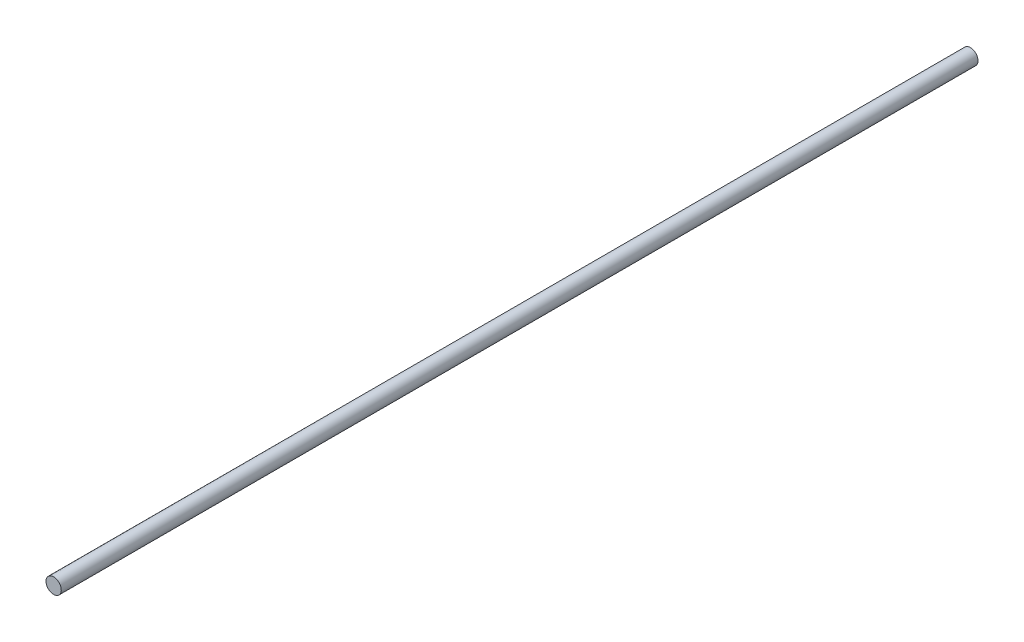
ISO-10303-21;
HEADER;
FILE_DESCRIPTION(('STEP AP214'),'2;1');
FILE_NAME('part.step','',(''),(''),'','','');
FILE_SCHEMA(('AUTOMOTIVE_DESIGN { 1 0 10303 214 1 1 1 1 }'));
ENDSEC;
DATA;
#1=APPLICATION_CONTEXT('core data for automotive mechanical design processes');
#2=APPLICATION_PROTOCOL_DEFINITION('international standard','automotive_design',2000,#1);
#3=PRODUCT_CONTEXT('',#1,'mechanical');
#4=PRODUCT('Part','Part','',(#3));
#5=PRODUCT_RELATED_PRODUCT_CATEGORY('part','',(#4));
#6=PRODUCT_DEFINITION_FORMATION('','',#4);
#7=PRODUCT_DEFINITION_CONTEXT('part definition',#1,'design');
#8=PRODUCT_DEFINITION('design','',#6,#7);
#9=PRODUCT_DEFINITION_SHAPE('','',#8);
#10=(LENGTH_UNIT() NAMED_UNIT(*) SI_UNIT(.MILLI.,.METRE.));
#11=(NAMED_UNIT(*) PLANE_ANGLE_UNIT() SI_UNIT($,.RADIAN.));
#12=(NAMED_UNIT(*) SI_UNIT($,.STERADIAN.) SOLID_ANGLE_UNIT());
#13=UNCERTAINTY_MEASURE_WITH_UNIT(LENGTH_MEASURE(1.E-05),#10,'distance_accuracy_value','');
#14=(GEOMETRIC_REPRESENTATION_CONTEXT(3) GLOBAL_UNCERTAINTY_ASSIGNED_CONTEXT((#13)) GLOBAL_UNIT_ASSIGNED_CONTEXT((#10,
#11,#12)) REPRESENTATION_CONTEXT('',''));
#15=CARTESIAN_POINT('',(0.,0.,0.));
#16=DIRECTION('',(0.,0.,1.));
#17=DIRECTION('',(1.,0.,0.));
#18=AXIS2_PLACEMENT_3D('',#15,#16,#17);
#19=CARTESIAN_POINT('',(0.,0.,150.));
#20=DIRECTION('',(0.,0.,-1.));
#21=DIRECTION('',(-1.,0.,0.));
#22=AXIS2_PLACEMENT_3D('',#19,#20,#21);
#23=CYLINDRICAL_SURFACE('',#22,1.25);
#24=CARTESIAN_POINT('',(0.,0.,150.));
#25=DIRECTION('',(0.,0.,1.));
#26=DIRECTION('',(1.,0.,0.));
#27=AXIS2_PLACEMENT_3D('',#24,#25,#26);
#28=CIRCLE('',#27,1.25);
#29=CARTESIAN_POINT('',(1.25,0.,150.));
#30=VERTEX_POINT('',#29);
#31=EDGE_CURVE('E10',#30,#30,#28,.T.);
#32=ORIENTED_EDGE('',*,*,#31,.F.);
#33=EDGE_LOOP('',(#32));
#34=FACE_BOUND('',#33,.T.);
#35=CARTESIAN_POINT('',(0.,0.,0.));
#36=DIRECTION('',(0.,0.,1.));
#37=DIRECTION('',(1.,0.,0.));
#38=AXIS2_PLACEMENT_3D('',#35,#36,#37);
#39=CIRCLE('',#38,1.25);
#40=CARTESIAN_POINT('',(1.25,0.,0.));
#41=VERTEX_POINT('',#40);
#42=EDGE_CURVE('E40',#41,#41,#39,.T.);
#43=ORIENTED_EDGE('',*,*,#42,.T.);
#44=EDGE_LOOP('',(#43));
#45=FACE_BOUND('',#44,.T.);
#46=ADVANCED_FACE('F37',(#34,#45),#23,.T.);
#47=CARTESIAN_POINT('',(0.,0.,150.));
#48=DIRECTION('',(0.,0.,1.));
#49=DIRECTION('',(1.,0.,0.));
#50=AXIS2_PLACEMENT_3D('',#47,#48,#49);
#51=PLANE('',#50);
#52=ORIENTED_EDGE('',*,*,#31,.T.);
#53=EDGE_LOOP('',(#52));
#54=FACE_BOUND('',#53,.T.);
#55=ADVANCED_FACE('F54',(#54),#51,.T.);
#56=CARTESIAN_POINT('',(0.,0.,0.));
#57=DIRECTION('',(0.,0.,1.));
#58=DIRECTION('',(1.,0.,0.));
#59=AXIS2_PLACEMENT_3D('',#56,#57,#58);
#60=PLANE('',#59);
#61=ORIENTED_EDGE('',*,*,#42,.F.);
#62=EDGE_LOOP('',(#61));
#63=FACE_BOUND('',#62,.T.);
#64=ADVANCED_FACE('F52',(#63),#60,.F.);
#65=CLOSED_SHELL('',(#46,#55,#64));
#66=MANIFOLD_SOLID_BREP('B2',#65);
#67=ADVANCED_BREP_SHAPE_REPRESENTATION('',(#18,#66),#14);
#68=SHAPE_DEFINITION_REPRESENTATION(#9,#67);
ENDSEC;
END-ISO-10303-21;
